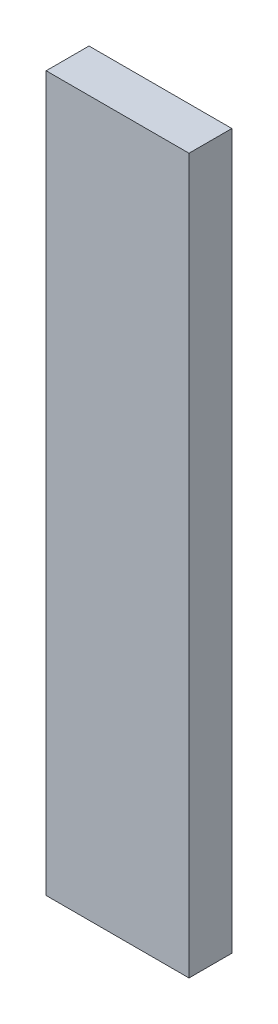
ISO-10303-21;
HEADER;
FILE_DESCRIPTION(('STEP AP214'),'2;1');
FILE_NAME('part.step','',(''),(''),'','','');
FILE_SCHEMA(('AUTOMOTIVE_DESIGN { 1 0 10303 214 1 1 1 1 }'));
ENDSEC;
DATA;
#1=APPLICATION_CONTEXT('core data for automotive mechanical design processes');
#2=APPLICATION_PROTOCOL_DEFINITION('international standard','automotive_design',2000,#1);
#3=PRODUCT_CONTEXT('',#1,'mechanical');
#4=PRODUCT('Part','Part','',(#3));
#5=PRODUCT_RELATED_PRODUCT_CATEGORY('part','',(#4));
#6=PRODUCT_DEFINITION_FORMATION('','',#4);
#7=PRODUCT_DEFINITION_CONTEXT('part definition',#1,'design');
#8=PRODUCT_DEFINITION('design','',#6,#7);
#9=PRODUCT_DEFINITION_SHAPE('','',#8);
#10=(LENGTH_UNIT() NAMED_UNIT(*) SI_UNIT(.MILLI.,.METRE.));
#11=(NAMED_UNIT(*) PLANE_ANGLE_UNIT() SI_UNIT($,.RADIAN.));
#12=(NAMED_UNIT(*) SI_UNIT($,.STERADIAN.) SOLID_ANGLE_UNIT());
#13=UNCERTAINTY_MEASURE_WITH_UNIT(LENGTH_MEASURE(1.E-05),#10,'distance_accuracy_value','');
#14=(GEOMETRIC_REPRESENTATION_CONTEXT(3) GLOBAL_UNCERTAINTY_ASSIGNED_CONTEXT((#13)) GLOBAL_UNIT_ASSIGNED_CONTEXT((#10,
#11,#12)) REPRESENTATION_CONTEXT('',''));
#15=CARTESIAN_POINT('',(0.,0.,0.));
#16=DIRECTION('',(0.,0.,1.));
#17=DIRECTION('',(1.,0.,0.));
#18=AXIS2_PLACEMENT_3D('',#15,#16,#17);
#19=CARTESIAN_POINT('',(20.8364080923857,51.,3.));
#20=DIRECTION('',(1.,0.,0.));
#21=DIRECTION('',(0.,0.,-1.));
#22=AXIS2_PLACEMENT_3D('',#19,#20,#21);
#23=PLANE('',#22);
#24=DIRECTION('',(0.,-1.,0.));
#25=VECTOR('',#24,1.);
#26=CARTESIAN_POINT('',(20.8364080923857,51.,0.));
#27=LINE('',#26,#25);
#28=CARTESIAN_POINT('',(20.8364080923857,51.,0.));
#29=VERTEX_POINT('',#28);
#30=CARTESIAN_POINT('',(20.8364080923857,1.00000000000003,0.));
#31=VERTEX_POINT('',#30);
#32=EDGE_CURVE('E97',#29,#31,#27,.T.);
#33=ORIENTED_EDGE('',*,*,#32,.T.);
#34=DIRECTION('',(0.,0.,-1.));
#35=VECTOR('',#34,1.);
#36=CARTESIAN_POINT('',(20.8364080923857,1.00000000000003,3.));
#37=LINE('',#36,#35);
#38=CARTESIAN_POINT('',(20.8364080923857,1.00000000000003,3.));
#39=VERTEX_POINT('',#38);
#40=EDGE_CURVE('E11',#39,#31,#37,.T.);
#41=ORIENTED_EDGE('',*,*,#40,.F.);
#42=DIRECTION('',(0.,-1.,0.));
#43=VECTOR('',#42,1.);
#44=CARTESIAN_POINT('',(20.8364080923857,51.,3.));
#45=LINE('',#44,#43);
#46=CARTESIAN_POINT('',(20.8364080923857,51.,3.));
#47=VERTEX_POINT('',#46);
#48=EDGE_CURVE('E83',#47,#39,#45,.T.);
#49=ORIENTED_EDGE('',*,*,#48,.F.);
#50=DIRECTION('',(0.,0.,-1.));
#51=VECTOR('',#50,1.);
#52=CARTESIAN_POINT('',(20.8364080923857,51.,3.));
#53=LINE('',#52,#51);
#54=EDGE_CURVE('E93',#47,#29,#53,.T.);
#55=ORIENTED_EDGE('',*,*,#54,.T.);
#56=EDGE_LOOP('',(#33,#41,#49,#55));
#57=FACE_BOUND('',#56,.T.);
#58=ADVANCED_FACE('F33',(#57),#23,.F.);
#59=CARTESIAN_POINT('',(20.8364080923857,1.00000000000003,3.));
#60=DIRECTION('',(0.,1.,0.));
#61=DIRECTION('',(0.,0.,1.));
#62=AXIS2_PLACEMENT_3D('',#59,#60,#61);
#63=PLANE('',#62);
#64=DIRECTION('',(1.,0.,0.));
#65=VECTOR('',#64,1.);
#66=CARTESIAN_POINT('',(20.8364080923857,1.00000000000003,0.));
#67=LINE('',#66,#65);
#68=CARTESIAN_POINT('',(30.8363886323423,1.00000000000003,0.));
#69=VERTEX_POINT('',#68);
#70=EDGE_CURVE('E88',#31,#69,#67,.T.);
#71=ORIENTED_EDGE('',*,*,#70,.T.);
#72=DIRECTION('',(0.,0.,-1.));
#73=VECTOR('',#72,1.);
#74=CARTESIAN_POINT('',(30.8363886323423,1.00000000000003,3.));
#75=LINE('',#74,#73);
#76=CARTESIAN_POINT('',(30.8363886323423,1.00000000000003,3.));
#77=VERTEX_POINT('',#76);
#78=EDGE_CURVE('E41',#77,#69,#75,.T.);
#79=ORIENTED_EDGE('',*,*,#78,.F.);
#80=DIRECTION('',(1.,0.,0.));
#81=VECTOR('',#80,1.);
#82=CARTESIAN_POINT('',(20.8364080923857,1.00000000000003,3.));
#83=LINE('',#82,#81);
#84=EDGE_CURVE('E77',#39,#77,#83,.T.);
#85=ORIENTED_EDGE('',*,*,#84,.F.);
#86=ORIENTED_EDGE('',*,*,#40,.T.);
#87=EDGE_LOOP('',(#71,#79,#85,#86));
#88=FACE_BOUND('',#87,.T.);
#89=ADVANCED_FACE('F87',(#88),#63,.F.);
#90=CARTESIAN_POINT('',(30.8363886323423,51.,3.));
#91=DIRECTION('',(-1.,0.,0.));
#92=DIRECTION('',(0.,-1.,0.));
#93=AXIS2_PLACEMENT_3D('',#90,#91,#92);
#94=PLANE('',#93);
#95=DIRECTION('',(0.,1.,0.));
#96=VECTOR('',#95,1.);
#97=CARTESIAN_POINT('',(30.8363886323423,51.,0.));
#98=LINE('',#97,#96);
#99=CARTESIAN_POINT('',(30.8363886323423,51.,0.));
#100=VERTEX_POINT('',#99);
#101=EDGE_CURVE('E101',#69,#100,#98,.T.);
#102=ORIENTED_EDGE('',*,*,#101,.T.);
#103=DIRECTION('',(0.,0.,-1.));
#104=VECTOR('',#103,1.);
#105=CARTESIAN_POINT('',(30.8363886323423,51.,3.));
#106=LINE('',#105,#104);
#107=CARTESIAN_POINT('',(30.8363886323423,51.,3.));
#108=VERTEX_POINT('',#107);
#109=EDGE_CURVE('E90',#108,#100,#106,.T.);
#110=ORIENTED_EDGE('',*,*,#109,.F.);
#111=DIRECTION('',(0.,1.,0.));
#112=VECTOR('',#111,1.);
#113=CARTESIAN_POINT('',(30.8363886323423,51.,3.));
#114=LINE('',#113,#112);
#115=EDGE_CURVE('E80',#77,#108,#114,.T.);
#116=ORIENTED_EDGE('',*,*,#115,.F.);
#117=ORIENTED_EDGE('',*,*,#78,.T.);
#118=EDGE_LOOP('',(#102,#110,#116,#117));
#119=FACE_BOUND('',#118,.T.);
#120=ADVANCED_FACE('F91',(#119),#94,.F.);
#121=CARTESIAN_POINT('',(20.8364080923857,51.,3.));
#122=DIRECTION('',(0.,-1.,0.));
#123=DIRECTION('',(0.,0.,-1.));
#124=AXIS2_PLACEMENT_3D('',#121,#122,#123);
#125=PLANE('',#124);
#126=DIRECTION('',(-1.,0.,0.));
#127=VECTOR('',#126,1.);
#128=CARTESIAN_POINT('',(20.8364080923857,51.,0.));
#129=LINE('',#128,#127);
#130=EDGE_CURVE('E66',#100,#29,#129,.T.);
#131=ORIENTED_EDGE('',*,*,#130,.T.);
#132=ORIENTED_EDGE('',*,*,#54,.F.);
#133=DIRECTION('',(-1.,0.,0.));
#134=VECTOR('',#133,1.);
#135=CARTESIAN_POINT('',(25.3363886323423,51.,3.));
#136=LINE('',#135,#134);
#137=EDGE_CURVE('E49',#108,#47,#136,.T.);
#138=ORIENTED_EDGE('',*,*,#137,.F.);
#139=ORIENTED_EDGE('',*,*,#109,.T.);
#140=EDGE_LOOP('',(#131,#132,#138,#139));
#141=FACE_BOUND('',#140,.T.);
#142=ADVANCED_FACE('F105',(#141),#125,.F.);
#143=CARTESIAN_POINT('',(0.,0.,3.));
#144=DIRECTION('',(0.,0.,1.));
#145=DIRECTION('',(1.,0.,0.));
#146=AXIS2_PLACEMENT_3D('',#143,#144,#145);
#147=PLANE('',#146);
#148=ORIENTED_EDGE('',*,*,#48,.T.);
#149=ORIENTED_EDGE('',*,*,#84,.T.);
#150=ORIENTED_EDGE('',*,*,#115,.T.);
#151=ORIENTED_EDGE('',*,*,#137,.T.);
#152=EDGE_LOOP('',(#148,#149,#150,#151));
#153=FACE_BOUND('',#152,.T.);
#154=ADVANCED_FACE('F78',(#153),#147,.T.);
#155=CARTESIAN_POINT('',(0.,0.,0.));
#156=DIRECTION('',(0.,0.,1.));
#157=DIRECTION('',(1.,0.,0.));
#158=AXIS2_PLACEMENT_3D('',#155,#156,#157);
#159=PLANE('',#158);
#160=ORIENTED_EDGE('',*,*,#32,.F.);
#161=ORIENTED_EDGE('',*,*,#130,.F.);
#162=ORIENTED_EDGE('',*,*,#101,.F.);
#163=ORIENTED_EDGE('',*,*,#70,.F.);
#164=EDGE_LOOP('',(#160,#161,#162,#163));
#165=FACE_BOUND('',#164,.T.);
#166=ADVANCED_FACE('F107',(#165),#159,.F.);
#167=CLOSED_SHELL('',(#58,#89,#120,#142,#154,#166));
#168=MANIFOLD_SOLID_BREP('B2',#167);
#169=ADVANCED_BREP_SHAPE_REPRESENTATION('',(#18,#168),#14);
#170=SHAPE_DEFINITION_REPRESENTATION(#9,#169);
ENDSEC;
END-ISO-10303-21;
